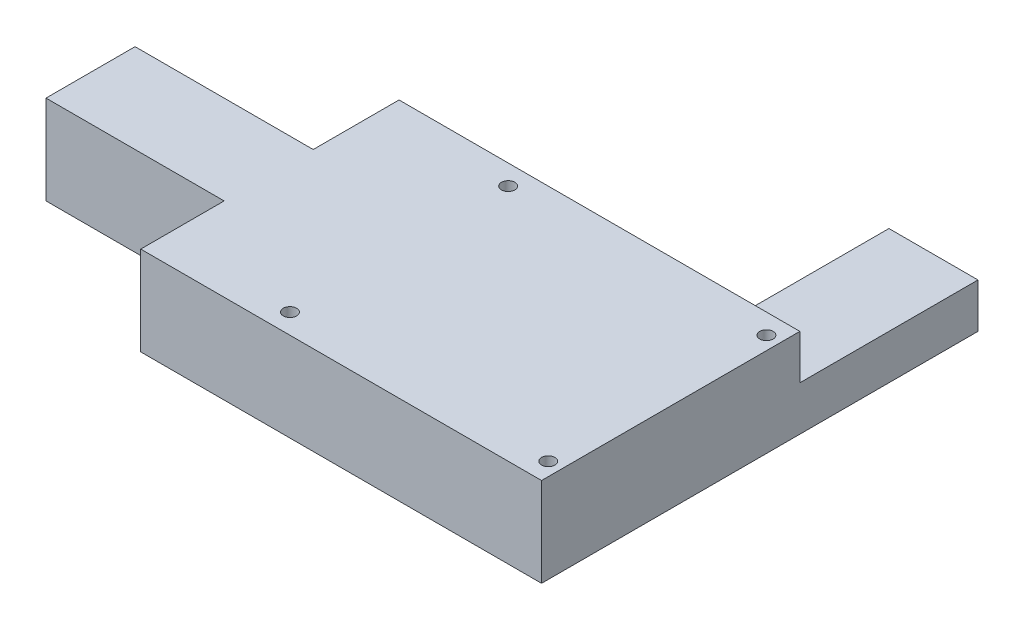
ISO-10303-21;
HEADER;
FILE_DESCRIPTION(('STEP AP214'),'2;1');
FILE_NAME('part.step','',(''),(''),'','','');
FILE_SCHEMA(('AUTOMOTIVE_DESIGN { 1 0 10303 214 1 1 1 1 }'));
ENDSEC;
DATA;
#1=APPLICATION_CONTEXT('core data for automotive mechanical design processes');
#2=APPLICATION_PROTOCOL_DEFINITION('international standard','automotive_design',2000,#1);
#3=PRODUCT_CONTEXT('',#1,'mechanical');
#4=PRODUCT('Part','Part','',(#3));
#5=PRODUCT_RELATED_PRODUCT_CATEGORY('part','',(#4));
#6=PRODUCT_DEFINITION_FORMATION('','',#4);
#7=PRODUCT_DEFINITION_CONTEXT('part definition',#1,'design');
#8=PRODUCT_DEFINITION('design','',#6,#7);
#9=PRODUCT_DEFINITION_SHAPE('','',#8);
#10=(LENGTH_UNIT() NAMED_UNIT(*) SI_UNIT(.MILLI.,.METRE.));
#11=(NAMED_UNIT(*) PLANE_ANGLE_UNIT() SI_UNIT($,.RADIAN.));
#12=(NAMED_UNIT(*) SI_UNIT($,.STERADIAN.) SOLID_ANGLE_UNIT());
#13=UNCERTAINTY_MEASURE_WITH_UNIT(LENGTH_MEASURE(1.E-05),#10,'distance_accuracy_value','');
#14=(GEOMETRIC_REPRESENTATION_CONTEXT(3) GLOBAL_UNCERTAINTY_ASSIGNED_CONTEXT((#13)) GLOBAL_UNIT_ASSIGNED_CONTEXT((#10,
#11,#12)) REPRESENTATION_CONTEXT('',''));
#15=CARTESIAN_POINT('',(0.,0.,0.));
#16=DIRECTION('',(0.,0.,1.));
#17=DIRECTION('',(1.,0.,0.));
#18=AXIS2_PLACEMENT_3D('',#15,#16,#17);
#19=CARTESIAN_POINT('',(-45.,20.,29.));
#20=DIRECTION('',(1.,0.,0.));
#21=DIRECTION('',(0.,0.,-1.));
#22=AXIS2_PLACEMENT_3D('',#19,#20,#21);
#23=PLANE('',#22);
#24=DIRECTION('',(0.,-1.,0.));
#25=VECTOR('',#24,1.);
#26=CARTESIAN_POINT('',(-45.,0.,-9.72745634094131));
#27=LINE('',#26,#25);
#28=CARTESIAN_POINT('',(-45.,20.,-9.72745634094128));
#29=VERTEX_POINT('',#28);
#30=CARTESIAN_POINT('',(-45.,0.,-9.72745634094128));
#31=VERTEX_POINT('',#30);
#32=EDGE_CURVE('E50',#29,#31,#27,.T.);
#33=ORIENTED_EDGE('',*,*,#32,.F.);
#34=DIRECTION('',(0.,0.,1.));
#35=VECTOR('',#34,1.);
#36=CARTESIAN_POINT('',(-45.,20.,29.));
#37=LINE('',#36,#35);
#38=CARTESIAN_POINT('',(-45.,20.,-29.));
#39=VERTEX_POINT('',#38);
#40=EDGE_CURVE('E178',#39,#29,#37,.T.);
#41=ORIENTED_EDGE('',*,*,#40,.F.);
#42=DIRECTION('',(0.,-1.,0.));
#43=VECTOR('',#42,1.);
#44=CARTESIAN_POINT('',(-45.,20.,-29.));
#45=LINE('',#44,#43);
#46=CARTESIAN_POINT('',(-45.,0.,-29.));
#47=VERTEX_POINT('',#46);
#48=EDGE_CURVE('E42',#39,#47,#45,.T.);
#49=ORIENTED_EDGE('',*,*,#48,.T.);
#50=DIRECTION('',(0.,0.,1.));
#51=VECTOR('',#50,1.);
#52=CARTESIAN_POINT('',(-45.,0.,29.));
#53=LINE('',#52,#51);
#54=EDGE_CURVE('E252',#47,#31,#53,.T.);
#55=ORIENTED_EDGE('',*,*,#54,.T.);
#56=EDGE_LOOP('',(#33,#41,#49,#55));
#57=FACE_BOUND('',#56,.T.);
#58=ADVANCED_FACE('F33',(#57),#23,.F.);
#59=DIRECTION('',(0.,1.,0.));
#60=VECTOR('',#59,1.);
#61=CARTESIAN_POINT('',(-45.,0.,10.2725436590587));
#62=LINE('',#61,#60);
#63=CARTESIAN_POINT('',(-45.,0.,10.2725436590587));
#64=VERTEX_POINT('',#63);
#65=CARTESIAN_POINT('',(-45.,20.,10.2725436590587));
#66=VERTEX_POINT('',#65);
#67=EDGE_CURVE('E58',#64,#66,#62,.T.);
#68=ORIENTED_EDGE('',*,*,#67,.F.);
#69=CARTESIAN_POINT('',(-45.,0.,29.));
#70=VERTEX_POINT('',#69);
#71=EDGE_CURVE('E186',#64,#70,#53,.T.);
#72=ORIENTED_EDGE('',*,*,#71,.T.);
#73=DIRECTION('',(0.,-1.,0.));
#74=VECTOR('',#73,1.);
#75=CARTESIAN_POINT('',(-45.,20.,29.));
#76=LINE('',#75,#74);
#77=CARTESIAN_POINT('',(-45.,20.,29.));
#78=VERTEX_POINT('',#77);
#79=EDGE_CURVE('E260',#78,#70,#76,.T.);
#80=ORIENTED_EDGE('',*,*,#79,.F.);
#81=EDGE_CURVE('E166',#66,#78,#37,.T.);
#82=ORIENTED_EDGE('',*,*,#81,.F.);
#83=EDGE_LOOP('',(#68,#72,#80,#82));
#84=FACE_BOUND('',#83,.T.);
#85=ADVANCED_FACE('F280',(#84),#23,.F.);
#86=CARTESIAN_POINT('',(-45.,20.,-29.));
#87=DIRECTION('',(0.,0.,1.));
#88=DIRECTION('',(1.,0.,0.));
#89=AXIS2_PLACEMENT_3D('',#86,#87,#88);
#90=PLANE('',#89);
#91=DIRECTION('',(1.,0.,0.));
#92=VECTOR('',#91,1.);
#93=CARTESIAN_POINT('',(25.,10.,-29.));
#94=LINE('',#93,#92);
#95=CARTESIAN_POINT('',(25.,10.,-29.));
#96=VERTEX_POINT('',#95);
#97=CARTESIAN_POINT('',(45.,10.,-29.));
#98=VERTEX_POINT('',#97);
#99=EDGE_CURVE('E144',#96,#98,#94,.T.);
#100=ORIENTED_EDGE('',*,*,#99,.F.);
#101=DIRECTION('',(0.,1.,0.));
#102=VECTOR('',#101,1.);
#103=CARTESIAN_POINT('',(25.,10.,-29.));
#104=LINE('',#103,#102);
#105=CARTESIAN_POINT('',(25.,0.,-29.));
#106=VERTEX_POINT('',#105);
#107=EDGE_CURVE('E141',#106,#96,#104,.T.);
#108=ORIENTED_EDGE('',*,*,#107,.F.);
#109=DIRECTION('',(-1.,0.,0.));
#110=VECTOR('',#109,1.);
#111=CARTESIAN_POINT('',(-45.,0.,-29.));
#112=LINE('',#111,#110);
#113=EDGE_CURVE('E196',#106,#47,#112,.T.);
#114=ORIENTED_EDGE('',*,*,#113,.T.);
#115=ORIENTED_EDGE('',*,*,#48,.F.);
#116=DIRECTION('',(-1.,0.,0.));
#117=VECTOR('',#116,1.);
#118=CARTESIAN_POINT('',(-45.,20.,-29.));
#119=LINE('',#118,#117);
#120=CARTESIAN_POINT('',(45.,20.,-29.));
#121=VERTEX_POINT('',#120);
#122=EDGE_CURVE('E179',#121,#39,#119,.T.);
#123=ORIENTED_EDGE('',*,*,#122,.F.);
#124=DIRECTION('',(0.,-1.,0.));
#125=VECTOR('',#124,1.);
#126=CARTESIAN_POINT('',(45.,20.,-29.));
#127=LINE('',#126,#125);
#128=EDGE_CURVE('E11',#121,#98,#127,.T.);
#129=ORIENTED_EDGE('',*,*,#128,.T.);
#130=EDGE_LOOP('',(#100,#108,#114,#115,#123,#129));
#131=FACE_BOUND('',#130,.T.);
#132=ADVANCED_FACE('F283',(#131),#90,.F.);
#133=CARTESIAN_POINT('',(45.,20.,29.));
#134=DIRECTION('',(-1.,0.,0.));
#135=DIRECTION('',(0.,0.,1.));
#136=AXIS2_PLACEMENT_3D('',#133,#134,#135);
#137=PLANE('',#136);
#138=DIRECTION('',(0.,0.,-1.));
#139=VECTOR('',#138,1.);
#140=CARTESIAN_POINT('',(45.,0.,29.));
#141=LINE('',#140,#139);
#142=CARTESIAN_POINT('',(45.,0.,29.));
#143=VERTEX_POINT('',#142);
#144=CARTESIAN_POINT('',(45.,0.,-69.));
#145=VERTEX_POINT('',#144);
#146=EDGE_CURVE('E194',#143,#145,#141,.T.);
#147=ORIENTED_EDGE('',*,*,#146,.T.);
#148=DIRECTION('',(0.,-1.,0.));
#149=VECTOR('',#148,1.);
#150=CARTESIAN_POINT('',(45.,10.,-69.));
#151=LINE('',#150,#149);
#152=CARTESIAN_POINT('',(45.,10.,-69.));
#153=VERTEX_POINT('',#152);
#154=EDGE_CURVE('E161',#153,#145,#151,.T.);
#155=ORIENTED_EDGE('',*,*,#154,.F.);
#156=DIRECTION('',(0.,0.,1.));
#157=VECTOR('',#156,1.);
#158=CARTESIAN_POINT('',(45.,10.,-69.));
#159=LINE('',#158,#157);
#160=EDGE_CURVE('E218',#153,#98,#159,.T.);
#161=ORIENTED_EDGE('',*,*,#160,.T.);
#162=ORIENTED_EDGE('',*,*,#128,.F.);
#163=DIRECTION('',(0.,0.,-1.));
#164=VECTOR('',#163,1.);
#165=CARTESIAN_POINT('',(45.,20.,29.));
#166=LINE('',#165,#164);
#167=CARTESIAN_POINT('',(45.,20.,29.));
#168=VERTEX_POINT('',#167);
#169=EDGE_CURVE('E248',#168,#121,#166,.T.);
#170=ORIENTED_EDGE('',*,*,#169,.F.);
#171=DIRECTION('',(0.,-1.,0.));
#172=VECTOR('',#171,1.);
#173=CARTESIAN_POINT('',(45.,20.,29.));
#174=LINE('',#173,#172);
#175=EDGE_CURVE('E183',#168,#143,#174,.T.);
#176=ORIENTED_EDGE('',*,*,#175,.T.);
#177=EDGE_LOOP('',(#147,#155,#161,#162,#170,#176));
#178=FACE_BOUND('',#177,.T.);
#179=ADVANCED_FACE('F35',(#178),#137,.F.);
#180=CARTESIAN_POINT('',(-45.,20.,29.));
#181=DIRECTION('',(0.,0.,-1.));
#182=DIRECTION('',(-1.,0.,0.));
#183=AXIS2_PLACEMENT_3D('',#180,#181,#182);
#184=PLANE('',#183);
#185=DIRECTION('',(1.,0.,0.));
#186=VECTOR('',#185,1.);
#187=CARTESIAN_POINT('',(-45.,0.,29.));
#188=LINE('',#187,#186);
#189=EDGE_CURVE('E249',#70,#143,#188,.T.);
#190=ORIENTED_EDGE('',*,*,#189,.T.);
#191=ORIENTED_EDGE('',*,*,#175,.F.);
#192=DIRECTION('',(1.,0.,0.));
#193=VECTOR('',#192,1.);
#194=CARTESIAN_POINT('',(-45.,20.,29.));
#195=LINE('',#194,#193);
#196=EDGE_CURVE('E182',#78,#168,#195,.T.);
#197=ORIENTED_EDGE('',*,*,#196,.F.);
#198=ORIENTED_EDGE('',*,*,#79,.T.);
#199=EDGE_LOOP('',(#190,#191,#197,#198));
#200=FACE_BOUND('',#199,.T.);
#201=ADVANCED_FACE('F282',(#200),#184,.F.);
#202=CARTESIAN_POINT('',(0.,20.,0.));
#203=DIRECTION('',(0.,-1.,0.));
#204=DIRECTION('',(0.,0.,-1.));
#205=AXIS2_PLACEMENT_3D('',#202,#203,#204);
#206=PLANE('',#205);
#207=CARTESIAN_POINT('',(-15.9999999999995,20.,24.5000000000004));
#208=DIRECTION('',(0.,1.,0.));
#209=DIRECTION('',(0.,0.,1.));
#210=AXIS2_PLACEMENT_3D('',#207,#208,#209);
#211=CIRCLE('',#210,1.5);
#212=CARTESIAN_POINT('',(-15.9999999999995,20.,26.0000000000004));
#213=VERTEX_POINT('',#212);
#214=EDGE_CURVE('E211',#213,#213,#211,.T.);
#215=ORIENTED_EDGE('',*,*,#214,.F.);
#216=EDGE_LOOP('',(#215));
#217=FACE_BOUND('',#216,.T.);
#218=CARTESIAN_POINT('',(-16.,20.,-24.4999999999996));
#219=DIRECTION('',(0.,1.,0.));
#220=DIRECTION('',(0.,0.,1.));
#221=AXIS2_PLACEMENT_3D('',#218,#219,#220);
#222=CIRCLE('',#221,1.5);
#223=CARTESIAN_POINT('',(-16.,20.,-22.9999999999996));
#224=VERTEX_POINT('',#223);
#225=EDGE_CURVE('E230',#224,#224,#222,.T.);
#226=ORIENTED_EDGE('',*,*,#225,.F.);
#227=EDGE_LOOP('',(#226));
#228=FACE_BOUND('',#227,.T.);
#229=CARTESIAN_POINT('',(42.0000000000005,20.,24.5));
#230=DIRECTION('',(0.,1.,0.));
#231=DIRECTION('',(0.,0.,1.));
#232=AXIS2_PLACEMENT_3D('',#229,#230,#231);
#233=CIRCLE('',#232,1.5);
#234=CARTESIAN_POINT('',(42.0000000000005,20.,26.));
#235=VERTEX_POINT('',#234);
#236=EDGE_CURVE('E236',#235,#235,#233,.T.);
#237=ORIENTED_EDGE('',*,*,#236,.F.);
#238=EDGE_LOOP('',(#237));
#239=FACE_BOUND('',#238,.T.);
#240=CARTESIAN_POINT('',(42.,20.,-24.5));
#241=DIRECTION('',(0.,1.,0.));
#242=DIRECTION('',(0.,0.,1.));
#243=AXIS2_PLACEMENT_3D('',#240,#241,#242);
#244=CIRCLE('',#243,1.5);
#245=CARTESIAN_POINT('',(42.,20.,-23.));
#246=VERTEX_POINT('',#245);
#247=EDGE_CURVE('E242',#246,#246,#244,.T.);
#248=ORIENTED_EDGE('',*,*,#247,.F.);
#249=EDGE_LOOP('',(#248));
#250=FACE_BOUND('',#249,.T.);
#251=ORIENTED_EDGE('',*,*,#169,.T.);
#252=ORIENTED_EDGE('',*,*,#122,.T.);
#253=ORIENTED_EDGE('',*,*,#40,.T.);
#254=DIRECTION('',(1.,0.,0.));
#255=VECTOR('',#254,1.);
#256=CARTESIAN_POINT('',(-85.,20.,-9.72745634094131));
#257=LINE('',#256,#255);
#258=CARTESIAN_POINT('',(-85.,20.,-9.72745634094131));
#259=VERTEX_POINT('',#258);
#260=EDGE_CURVE('E154',#259,#29,#257,.T.);
#261=ORIENTED_EDGE('',*,*,#260,.F.);
#262=DIRECTION('',(0.,0.,-1.));
#263=VECTOR('',#262,1.);
#264=CARTESIAN_POINT('',(-85.,20.,10.2725436590587));
#265=LINE('',#264,#263);
#266=CARTESIAN_POINT('',(-85.,20.,10.2725436590587));
#267=VERTEX_POINT('',#266);
#268=EDGE_CURVE('E135',#267,#259,#265,.T.);
#269=ORIENTED_EDGE('',*,*,#268,.F.);
#270=DIRECTION('',(1.,0.,0.));
#271=VECTOR('',#270,1.);
#272=CARTESIAN_POINT('',(-85.,20.,10.2725436590587));
#273=LINE('',#272,#271);
#274=EDGE_CURVE('E146',#267,#66,#273,.T.);
#275=ORIENTED_EDGE('',*,*,#274,.T.);
#276=ORIENTED_EDGE('',*,*,#81,.T.);
#277=ORIENTED_EDGE('',*,*,#196,.T.);
#278=EDGE_LOOP('',(#251,#252,#253,#261,#269,#275,#276,#277));
#279=FACE_BOUND('',#278,.T.);
#280=ADVANCED_FACE('F177',(#217,#228,#239,#250,#279),#206,.F.);
#281=CARTESIAN_POINT('',(0.,0.,0.));
#282=DIRECTION('',(0.,-1.,0.));
#283=DIRECTION('',(0.,0.,-1.));
#284=AXIS2_PLACEMENT_3D('',#281,#282,#283);
#285=PLANE('',#284);
#286=CARTESIAN_POINT('',(-15.9999999999995,0.,24.5000000000004));
#287=DIRECTION('',(0.,1.,0.));
#288=DIRECTION('',(0.,0.,1.));
#289=AXIS2_PLACEMENT_3D('',#286,#287,#288);
#290=CIRCLE('',#289,1.5);
#291=CARTESIAN_POINT('',(-15.9999999999995,0.,26.0000000000004));
#292=VERTEX_POINT('',#291);
#293=EDGE_CURVE('E227',#292,#292,#290,.T.);
#294=ORIENTED_EDGE('',*,*,#293,.T.);
#295=EDGE_LOOP('',(#294));
#296=FACE_BOUND('',#295,.T.);
#297=CARTESIAN_POINT('',(-16.,0.,-24.4999999999996));
#298=DIRECTION('',(0.,1.,0.));
#299=DIRECTION('',(0.,0.,1.));
#300=AXIS2_PLACEMENT_3D('',#297,#298,#299);
#301=CIRCLE('',#300,1.5);
#302=CARTESIAN_POINT('',(-16.,0.,-22.9999999999996));
#303=VERTEX_POINT('',#302);
#304=EDGE_CURVE('E233',#303,#303,#301,.T.);
#305=ORIENTED_EDGE('',*,*,#304,.T.);
#306=EDGE_LOOP('',(#305));
#307=FACE_BOUND('',#306,.T.);
#308=CARTESIAN_POINT('',(42.0000000000005,0.,24.5));
#309=DIRECTION('',(0.,1.,0.));
#310=DIRECTION('',(0.,0.,1.));
#311=AXIS2_PLACEMENT_3D('',#308,#309,#310);
#312=CIRCLE('',#311,1.5);
#313=CARTESIAN_POINT('',(42.0000000000005,0.,26.));
#314=VERTEX_POINT('',#313);
#315=EDGE_CURVE('E239',#314,#314,#312,.T.);
#316=ORIENTED_EDGE('',*,*,#315,.T.);
#317=EDGE_LOOP('',(#316));
#318=FACE_BOUND('',#317,.T.);
#319=CARTESIAN_POINT('',(42.,0.,-24.5));
#320=DIRECTION('',(0.,1.,0.));
#321=DIRECTION('',(0.,0.,1.));
#322=AXIS2_PLACEMENT_3D('',#319,#320,#321);
#323=CIRCLE('',#322,1.5);
#324=CARTESIAN_POINT('',(42.,0.,-23.));
#325=VERTEX_POINT('',#324);
#326=EDGE_CURVE('E197',#325,#325,#323,.T.);
#327=ORIENTED_EDGE('',*,*,#326,.T.);
#328=EDGE_LOOP('',(#327));
#329=FACE_BOUND('',#328,.T.);
#330=ORIENTED_EDGE('',*,*,#146,.F.);
#331=ORIENTED_EDGE('',*,*,#189,.F.);
#332=ORIENTED_EDGE('',*,*,#71,.F.);
#333=DIRECTION('',(1.,0.,0.));
#334=VECTOR('',#333,1.);
#335=CARTESIAN_POINT('',(-85.,0.,10.2725436590587));
#336=LINE('',#335,#334);
#337=CARTESIAN_POINT('',(-85.,0.,10.2725436590587));
#338=VERTEX_POINT('',#337);
#339=EDGE_CURVE('E126',#338,#64,#336,.T.);
#340=ORIENTED_EDGE('',*,*,#339,.F.);
#341=DIRECTION('',(0.,0.,1.));
#342=VECTOR('',#341,1.);
#343=CARTESIAN_POINT('',(-85.,0.,10.2725436590587));
#344=LINE('',#343,#342);
#345=CARTESIAN_POINT('',(-85.,0.,-9.72745634094131));
#346=VERTEX_POINT('',#345);
#347=EDGE_CURVE('E118',#346,#338,#344,.T.);
#348=ORIENTED_EDGE('',*,*,#347,.F.);
#349=DIRECTION('',(1.,0.,0.));
#350=VECTOR('',#349,1.);
#351=CARTESIAN_POINT('',(-85.,0.,-9.72745634094131));
#352=LINE('',#351,#350);
#353=EDGE_CURVE('E124',#346,#31,#352,.T.);
#354=ORIENTED_EDGE('',*,*,#353,.T.);
#355=ORIENTED_EDGE('',*,*,#54,.F.);
#356=ORIENTED_EDGE('',*,*,#113,.F.);
#357=DIRECTION('',(0.,0.,1.));
#358=VECTOR('',#357,1.);
#359=CARTESIAN_POINT('',(25.,0.,-69.));
#360=LINE('',#359,#358);
#361=CARTESIAN_POINT('',(25.,0.,-69.));
#362=VERTEX_POINT('',#361);
#363=EDGE_CURVE('E208',#362,#106,#360,.T.);
#364=ORIENTED_EDGE('',*,*,#363,.F.);
#365=DIRECTION('',(-1.,0.,0.));
#366=VECTOR('',#365,1.);
#367=CARTESIAN_POINT('',(25.,0.,-69.));
#368=LINE('',#367,#366);
#369=EDGE_CURVE('E272',#145,#362,#368,.T.);
#370=ORIENTED_EDGE('',*,*,#369,.F.);
#371=EDGE_LOOP('',(#330,#331,#332,#340,#348,#354,#355,#356,#364,#370));
#372=FACE_BOUND('',#371,.T.);
#373=ADVANCED_FACE('F121',(#296,#307,#318,#329,#372),#285,.T.);
#374=CARTESIAN_POINT('',(42.,0.,-24.5));
#375=DIRECTION('',(0.,1.,0.));
#376=DIRECTION('',(0.,0.,1.));
#377=AXIS2_PLACEMENT_3D('',#374,#375,#376);
#378=CYLINDRICAL_SURFACE('',#377,1.5);
#379=ORIENTED_EDGE('',*,*,#326,.F.);
#380=EDGE_LOOP('',(#379));
#381=FACE_BOUND('',#380,.T.);
#382=ORIENTED_EDGE('',*,*,#247,.T.);
#383=EDGE_LOOP('',(#382));
#384=FACE_BOUND('',#383,.T.);
#385=ADVANCED_FACE('F321',(#381,#384),#378,.F.);
#386=CARTESIAN_POINT('',(42.0000000000005,0.,24.5));
#387=DIRECTION('',(0.,1.,0.));
#388=DIRECTION('',(0.,0.,1.));
#389=AXIS2_PLACEMENT_3D('',#386,#387,#388);
#390=CYLINDRICAL_SURFACE('',#389,1.5);
#391=ORIENTED_EDGE('',*,*,#315,.F.);
#392=EDGE_LOOP('',(#391));
#393=FACE_BOUND('',#392,.T.);
#394=ORIENTED_EDGE('',*,*,#236,.T.);
#395=EDGE_LOOP('',(#394));
#396=FACE_BOUND('',#395,.T.);
#397=ADVANCED_FACE('F327',(#393,#396),#390,.F.);
#398=CARTESIAN_POINT('',(-16.,0.,-24.4999999999996));
#399=DIRECTION('',(0.,1.,0.));
#400=DIRECTION('',(0.,0.,1.));
#401=AXIS2_PLACEMENT_3D('',#398,#399,#400);
#402=CYLINDRICAL_SURFACE('',#401,1.5);
#403=ORIENTED_EDGE('',*,*,#304,.F.);
#404=EDGE_LOOP('',(#403));
#405=FACE_BOUND('',#404,.T.);
#406=ORIENTED_EDGE('',*,*,#225,.T.);
#407=EDGE_LOOP('',(#406));
#408=FACE_BOUND('',#407,.T.);
#409=ADVANCED_FACE('F331',(#405,#408),#402,.F.);
#410=CARTESIAN_POINT('',(-15.9999999999995,0.,24.5000000000004));
#411=DIRECTION('',(0.,1.,0.));
#412=DIRECTION('',(0.,0.,1.));
#413=AXIS2_PLACEMENT_3D('',#410,#411,#412);
#414=CYLINDRICAL_SURFACE('',#413,1.5);
#415=ORIENTED_EDGE('',*,*,#293,.F.);
#416=EDGE_LOOP('',(#415));
#417=FACE_BOUND('',#416,.T.);
#418=ORIENTED_EDGE('',*,*,#214,.T.);
#419=EDGE_LOOP('',(#418));
#420=FACE_BOUND('',#419,.T.);
#421=ADVANCED_FACE('F293',(#417,#420),#414,.F.);
#422=CARTESIAN_POINT('',(25.,10.,-69.));
#423=DIRECTION('',(1.,0.,0.));
#424=DIRECTION('',(0.,1.,0.));
#425=AXIS2_PLACEMENT_3D('',#422,#423,#424);
#426=PLANE('',#425);
#427=ORIENTED_EDGE('',*,*,#107,.T.);
#428=DIRECTION('',(0.,0.,1.));
#429=VECTOR('',#428,1.);
#430=CARTESIAN_POINT('',(25.,10.,-69.));
#431=LINE('',#430,#429);
#432=CARTESIAN_POINT('',(25.,10.,-69.));
#433=VERTEX_POINT('',#432);
#434=EDGE_CURVE('E212',#433,#96,#431,.T.);
#435=ORIENTED_EDGE('',*,*,#434,.F.);
#436=DIRECTION('',(0.,1.,0.));
#437=VECTOR('',#436,1.);
#438=CARTESIAN_POINT('',(25.,10.,-69.));
#439=LINE('',#438,#437);
#440=EDGE_CURVE('E269',#362,#433,#439,.T.);
#441=ORIENTED_EDGE('',*,*,#440,.F.);
#442=ORIENTED_EDGE('',*,*,#363,.T.);
#443=EDGE_LOOP('',(#427,#435,#441,#442));
#444=FACE_BOUND('',#443,.T.);
#445=ADVANCED_FACE('F267',(#444),#426,.F.);
#446=CARTESIAN_POINT('',(25.,10.,-69.));
#447=DIRECTION('',(0.,-1.,0.));
#448=DIRECTION('',(1.,0.,0.));
#449=AXIS2_PLACEMENT_3D('',#446,#447,#448);
#450=PLANE('',#449);
#451=ORIENTED_EDGE('',*,*,#99,.T.);
#452=ORIENTED_EDGE('',*,*,#160,.F.);
#453=DIRECTION('',(1.,0.,0.));
#454=VECTOR('',#453,1.);
#455=CARTESIAN_POINT('',(25.,10.,-69.));
#456=LINE('',#455,#454);
#457=EDGE_CURVE('E223',#433,#153,#456,.T.);
#458=ORIENTED_EDGE('',*,*,#457,.F.);
#459=ORIENTED_EDGE('',*,*,#434,.T.);
#460=EDGE_LOOP('',(#451,#452,#458,#459));
#461=FACE_BOUND('',#460,.T.);
#462=ADVANCED_FACE('F285',(#461),#450,.F.);
#463=CARTESIAN_POINT('',(0.,0.,-69.));
#464=DIRECTION('',(0.,0.,1.));
#465=DIRECTION('',(1.,0.,0.));
#466=AXIS2_PLACEMENT_3D('',#463,#464,#465);
#467=PLANE('',#466);
#468=ORIENTED_EDGE('',*,*,#154,.T.);
#469=ORIENTED_EDGE('',*,*,#369,.T.);
#470=ORIENTED_EDGE('',*,*,#440,.T.);
#471=ORIENTED_EDGE('',*,*,#457,.T.);
#472=EDGE_LOOP('',(#468,#469,#470,#471));
#473=FACE_BOUND('',#472,.T.);
#474=ADVANCED_FACE('F275',(#473),#467,.F.);
#475=CARTESIAN_POINT('',(-85.,0.,-9.72745634094131));
#476=DIRECTION('',(0.,0.,1.));
#477=DIRECTION('',(1.,0.,0.));
#478=AXIS2_PLACEMENT_3D('',#475,#476,#477);
#479=PLANE('',#478);
#480=ORIENTED_EDGE('',*,*,#32,.T.);
#481=ORIENTED_EDGE('',*,*,#353,.F.);
#482=DIRECTION('',(0.,-1.,0.));
#483=VECTOR('',#482,1.);
#484=CARTESIAN_POINT('',(-85.,0.,-9.72745634094131));
#485=LINE('',#484,#483);
#486=EDGE_CURVE('E130',#259,#346,#485,.T.);
#487=ORIENTED_EDGE('',*,*,#486,.F.);
#488=ORIENTED_EDGE('',*,*,#260,.T.);
#489=EDGE_LOOP('',(#480,#481,#487,#488));
#490=FACE_BOUND('',#489,.T.);
#491=ADVANCED_FACE('F140',(#490),#479,.F.);
#492=CARTESIAN_POINT('',(-85.,0.,10.2725436590587));
#493=DIRECTION('',(0.,0.,-1.));
#494=DIRECTION('',(-1.,0.,0.));
#495=AXIS2_PLACEMENT_3D('',#492,#493,#494);
#496=PLANE('',#495);
#497=ORIENTED_EDGE('',*,*,#67,.T.);
#498=ORIENTED_EDGE('',*,*,#274,.F.);
#499=DIRECTION('',(0.,1.,0.));
#500=VECTOR('',#499,1.);
#501=CARTESIAN_POINT('',(-85.,0.,10.2725436590587));
#502=LINE('',#501,#500);
#503=EDGE_CURVE('E129',#338,#267,#502,.T.);
#504=ORIENTED_EDGE('',*,*,#503,.F.);
#505=ORIENTED_EDGE('',*,*,#339,.T.);
#506=EDGE_LOOP('',(#497,#498,#504,#505));
#507=FACE_BOUND('',#506,.T.);
#508=ADVANCED_FACE('F175',(#507),#496,.F.);
#509=CARTESIAN_POINT('',(-85.,0.,0.));
#510=DIRECTION('',(-1.,0.,0.));
#511=DIRECTION('',(0.,0.,1.));
#512=AXIS2_PLACEMENT_3D('',#509,#510,#511);
#513=PLANE('',#512);
#514=ORIENTED_EDGE('',*,*,#486,.T.);
#515=ORIENTED_EDGE('',*,*,#347,.T.);
#516=ORIENTED_EDGE('',*,*,#503,.T.);
#517=ORIENTED_EDGE('',*,*,#268,.T.);
#518=EDGE_LOOP('',(#514,#515,#516,#517));
#519=FACE_BOUND('',#518,.T.);
#520=ADVANCED_FACE('F133',(#519),#513,.T.);
#521=CLOSED_SHELL('',(#58,#85,#132,#179,#201,#280,#373,#385,#397,#409,#421,#445,#462,#474,#491,
#508,#520));
#522=MANIFOLD_SOLID_BREP('B2',#521);
#523=ADVANCED_BREP_SHAPE_REPRESENTATION('',(#18,#522),#14);
#524=SHAPE_DEFINITION_REPRESENTATION(#9,#523);
ENDSEC;
END-ISO-10303-21;
